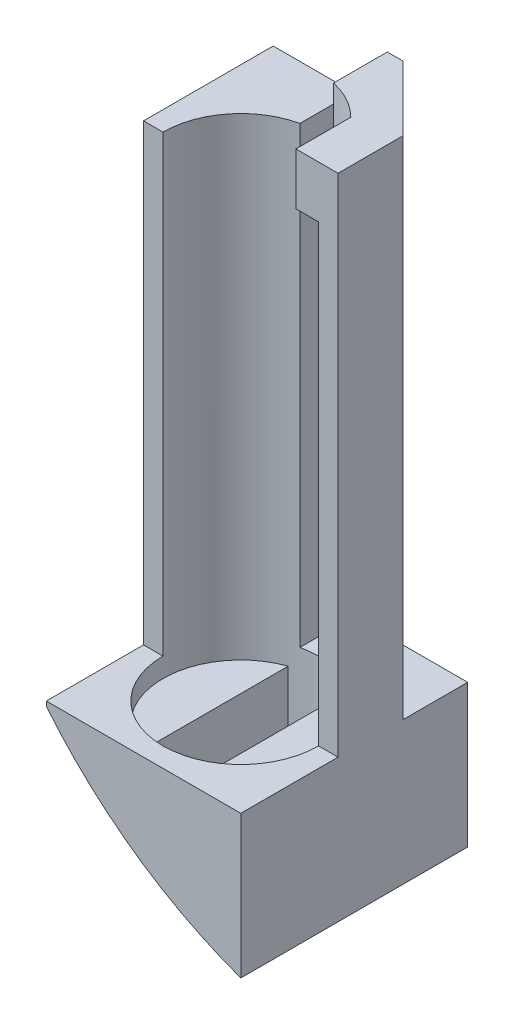
ISO-10303-21;
HEADER;
FILE_DESCRIPTION(('STEP AP214'),'2;1');
FILE_NAME('part.step','',(''),(''),'','','');
FILE_SCHEMA(('AUTOMOTIVE_DESIGN { 1 0 10303 214 1 1 1 1 }'));
ENDSEC;
DATA;
#1=APPLICATION_CONTEXT('core data for automotive mechanical design processes');
#2=APPLICATION_PROTOCOL_DEFINITION('international standard','automotive_design',2000,#1);
#3=PRODUCT_CONTEXT('',#1,'mechanical');
#4=PRODUCT('Part','Part','',(#3));
#5=PRODUCT_RELATED_PRODUCT_CATEGORY('part','',(#4));
#6=PRODUCT_DEFINITION_FORMATION('','',#4);
#7=PRODUCT_DEFINITION_CONTEXT('part definition',#1,'design');
#8=PRODUCT_DEFINITION('design','',#6,#7);
#9=PRODUCT_DEFINITION_SHAPE('','',#8);
#10=(LENGTH_UNIT() NAMED_UNIT(*) SI_UNIT(.MILLI.,.METRE.));
#11=(NAMED_UNIT(*) PLANE_ANGLE_UNIT() SI_UNIT($,.RADIAN.));
#12=(NAMED_UNIT(*) SI_UNIT($,.STERADIAN.) SOLID_ANGLE_UNIT());
#13=UNCERTAINTY_MEASURE_WITH_UNIT(LENGTH_MEASURE(1.E-05),#10,'distance_accuracy_value','');
#14=(GEOMETRIC_REPRESENTATION_CONTEXT(3) GLOBAL_UNCERTAINTY_ASSIGNED_CONTEXT((#13)) GLOBAL_UNIT_ASSIGNED_CONTEXT((#10,
#11,#12)) REPRESENTATION_CONTEXT('',''));
#15=CARTESIAN_POINT('',(0.,0.,0.));
#16=DIRECTION('',(0.,0.,1.));
#17=DIRECTION('',(1.,0.,0.));
#18=AXIS2_PLACEMENT_3D('',#15,#16,#17);
#19=CARTESIAN_POINT('',(0.,-3.,0.));
#20=DIRECTION('',(0.,1.,0.));
#21=DIRECTION('',(0.,0.,1.));
#22=AXIS2_PLACEMENT_3D('',#19,#20,#21);
#23=PLANE('',#22);
#24=DIRECTION('',(0.,0.,1.));
#25=VECTOR('',#24,1.);
#26=CARTESIAN_POINT('',(-4.,-3.,0.));
#27=LINE('',#26,#25);
#28=CARTESIAN_POINT('',(-4.,-3.,-11.3137084989848));
#29=VERTEX_POINT('',#28);
#30=CARTESIAN_POINT('',(-4.,-3.,11.3137084989848));
#31=VERTEX_POINT('',#30);
#32=EDGE_CURVE('E11',#29,#31,#27,.T.);
#33=ORIENTED_EDGE('',*,*,#32,.F.);
#34=CARTESIAN_POINT('',(0.,-3.,0.));
#35=DIRECTION('',(0.,1.,0.));
#36=DIRECTION('',(0.,0.,1.));
#37=AXIS2_PLACEMENT_3D('',#34,#35,#36);
#38=CIRCLE('',#37,12.);
#39=EDGE_CURVE('E306',#29,#31,#38,.T.);
#40=ORIENTED_EDGE('',*,*,#39,.T.);
#41=EDGE_LOOP('',(#33,#40));
#42=FACE_BOUND('',#41,.T.);
#43=ADVANCED_FACE('F45',(#42),#23,.T.);
#44=CARTESIAN_POINT('',(0.,0.,0.));
#45=DIRECTION('',(0.,-1.,0.));
#46=DIRECTION('',(0.,0.,-1.));
#47=AXIS2_PLACEMENT_3D('',#44,#45,#46);
#48=PLANE('',#47);
#49=DIRECTION('',(1.,0.,0.));
#50=VECTOR('',#49,1.);
#51=CARTESIAN_POINT('',(12.,0.,0.));
#52=LINE('',#51,#50);
#53=CARTESIAN_POINT('',(12.,0.,0.));
#54=VERTEX_POINT('',#53);
#55=CARTESIAN_POINT('',(15.,0.,0.));
#56=VERTEX_POINT('',#55);
#57=EDGE_CURVE('E343',#54,#56,#52,.T.);
#58=ORIENTED_EDGE('',*,*,#57,.F.);
#59=CARTESIAN_POINT('',(0.,0.,0.));
#60=DIRECTION('',(0.,-1.,0.));
#61=DIRECTION('',(0.,0.,-1.));
#62=AXIS2_PLACEMENT_3D('',#59,#60,#61);
#63=CIRCLE('',#62,12.);
#64=CARTESIAN_POINT('',(-12.,0.,0.));
#65=VERTEX_POINT('',#64);
#66=EDGE_CURVE('E429',#54,#65,#63,.T.);
#67=ORIENTED_EDGE('',*,*,#66,.T.);
#68=DIRECTION('',(1.,0.,0.));
#69=VECTOR('',#68,1.);
#70=CARTESIAN_POINT('',(-15.,0.,0.));
#71=LINE('',#70,#69);
#72=CARTESIAN_POINT('',(-15.,0.,0.));
#73=VERTEX_POINT('',#72);
#74=EDGE_CURVE('E377',#73,#65,#71,.T.);
#75=ORIENTED_EDGE('',*,*,#74,.F.);
#76=DIRECTION('',(0.,0.,1.));
#77=VECTOR('',#76,1.);
#78=CARTESIAN_POINT('',(-15.,0.,-20.));
#79=LINE('',#78,#77);
#80=CARTESIAN_POINT('',(-15.,0.,15.));
#81=VERTEX_POINT('',#80);
#82=EDGE_CURVE('E333',#73,#81,#79,.T.);
#83=ORIENTED_EDGE('',*,*,#82,.T.);
#84=DIRECTION('',(1.,0.,0.));
#85=VECTOR('',#84,1.);
#86=CARTESIAN_POINT('',(15.,0.,15.));
#87=LINE('',#86,#85);
#88=CARTESIAN_POINT('',(15.,0.,15.));
#89=VERTEX_POINT('',#88);
#90=EDGE_CURVE('E326',#81,#89,#87,.T.);
#91=ORIENTED_EDGE('',*,*,#90,.T.);
#92=DIRECTION('',(0.,0.,-1.));
#93=VECTOR('',#92,1.);
#94=CARTESIAN_POINT('',(15.,0.,-20.));
#95=LINE('',#94,#93);
#96=EDGE_CURVE('E327',#89,#56,#95,.T.);
#97=ORIENTED_EDGE('',*,*,#96,.T.);
#98=EDGE_LOOP('',(#58,#67,#75,#83,#91,#97));
#99=FACE_BOUND('',#98,.T.);
#100=ADVANCED_FACE('F435',(#99),#48,.F.);
#101=CARTESIAN_POINT('',(5.,70.,-20.));
#102=DIRECTION('',(0.,0.,1.));
#103=DIRECTION('',(1.,0.,0.));
#104=AXIS2_PLACEMENT_3D('',#101,#102,#103);
#105=PLANE('',#104);
#106=CARTESIAN_POINT('',(38.5,42.8748795759961,-20.));
#107=DIRECTION('',(0.,0.,1.));
#108=DIRECTION('',(1.,0.,0.));
#109=AXIS2_PLACEMENT_3D('',#106,#107,#108);
#110=CIRCLE('',#109,69.);
#111=CARTESIAN_POINT('',(-15.,-0.699769016964391,-20.));
#112=VERTEX_POINT('',#111);
#113=CARTESIAN_POINT('',(15.,-22.,-20.));
#114=VERTEX_POINT('',#113);
#115=EDGE_CURVE('E315',#112,#114,#110,.T.);
#116=ORIENTED_EDGE('',*,*,#115,.F.);
#117=DIRECTION('',(0.,-1.,0.));
#118=VECTOR('',#117,1.);
#119=CARTESIAN_POINT('',(-15.,70.,-20.));
#120=LINE('',#119,#118);
#121=CARTESIAN_POINT('',(-15.,70.,-20.));
#122=VERTEX_POINT('',#121);
#123=EDGE_CURVE('E415',#122,#112,#120,.T.);
#124=ORIENTED_EDGE('',*,*,#123,.F.);
#125=DIRECTION('',(-1.,0.,0.));
#126=VECTOR('',#125,1.);
#127=CARTESIAN_POINT('',(5.,70.,-20.));
#128=LINE('',#127,#126);
#129=CARTESIAN_POINT('',(2.6,70.,-20.));
#130=VERTEX_POINT('',#129);
#131=EDGE_CURVE('E351',#130,#122,#128,.T.);
#132=ORIENTED_EDGE('',*,*,#131,.F.);
#133=DIRECTION('',(0.,-1.,0.));
#134=VECTOR('',#133,1.);
#135=CARTESIAN_POINT('',(2.6,78.,-20.));
#136=LINE('',#135,#134);
#137=CARTESIAN_POINT('',(2.6,78.,-20.));
#138=VERTEX_POINT('',#137);
#139=EDGE_CURVE('E250',#138,#130,#136,.T.);
#140=ORIENTED_EDGE('',*,*,#139,.F.);
#141=DIRECTION('',(-1.,0.,0.));
#142=VECTOR('',#141,1.);
#143=CARTESIAN_POINT('',(5.,78.,-20.));
#144=LINE('',#143,#142);
#145=CARTESIAN_POINT('',(5.,78.,-20.));
#146=VERTEX_POINT('',#145);
#147=EDGE_CURVE('E211',#146,#138,#144,.T.);
#148=ORIENTED_EDGE('',*,*,#147,.F.);
#149=DIRECTION('',(0.,-1.,0.));
#150=VECTOR('',#149,1.);
#151=CARTESIAN_POINT('',(5.,70.,-20.));
#152=LINE('',#151,#150);
#153=CARTESIAN_POINT('',(5.,0.,-20.));
#154=VERTEX_POINT('',#153);
#155=EDGE_CURVE('E202',#146,#154,#152,.T.);
#156=ORIENTED_EDGE('',*,*,#155,.T.);
#157=DIRECTION('',(-1.,0.,0.));
#158=VECTOR('',#157,1.);
#159=CARTESIAN_POINT('',(15.,0.,-20.));
#160=LINE('',#159,#158);
#161=CARTESIAN_POINT('',(15.,0.,-20.));
#162=VERTEX_POINT('',#161);
#163=EDGE_CURVE('E330',#162,#154,#160,.T.);
#164=ORIENTED_EDGE('',*,*,#163,.F.);
#165=DIRECTION('',(0.,1.,0.));
#166=VECTOR('',#165,1.);
#167=CARTESIAN_POINT('',(15.,-22.,-20.));
#168=LINE('',#167,#166);
#169=EDGE_CURVE('E325',#114,#162,#168,.T.);
#170=ORIENTED_EDGE('',*,*,#169,.F.);
#171=EDGE_LOOP('',(#116,#124,#132,#140,#148,#156,#164,#170));
#172=FACE_BOUND('',#171,.T.);
#173=ADVANCED_FACE('F497',(#172),#105,.F.);
#174=CARTESIAN_POINT('',(-15.,70.,-20.));
#175=DIRECTION('',(1.,0.,0.));
#176=DIRECTION('',(0.,0.,-1.));
#177=AXIS2_PLACEMENT_3D('',#174,#175,#176);
#178=PLANE('',#177);
#179=DIRECTION('',(0.,0.,1.));
#180=VECTOR('',#179,1.);
#181=CARTESIAN_POINT('',(-15.,-0.699769016964391,-20.));
#182=LINE('',#181,#180);
#183=CARTESIAN_POINT('',(-15.,-0.699769016964391,15.));
#184=VERTEX_POINT('',#183);
#185=EDGE_CURVE('E318',#184,#112,#182,.F.);
#186=ORIENTED_EDGE('',*,*,#185,.F.);
#187=DIRECTION('',(0.,1.,0.));
#188=VECTOR('',#187,1.);
#189=CARTESIAN_POINT('',(-15.,-22.,15.));
#190=LINE('',#189,#188);
#191=EDGE_CURVE('E344',#184,#81,#190,.T.);
#192=ORIENTED_EDGE('',*,*,#191,.T.);
#193=ORIENTED_EDGE('',*,*,#82,.F.);
#194=DIRECTION('',(0.,-1.,0.));
#195=VECTOR('',#194,1.);
#196=CARTESIAN_POINT('',(-15.,70.,0.));
#197=LINE('',#196,#195);
#198=CARTESIAN_POINT('',(-15.,70.,0.));
#199=VERTEX_POINT('',#198);
#200=EDGE_CURVE('E411',#199,#73,#197,.T.);
#201=ORIENTED_EDGE('',*,*,#200,.F.);
#202=DIRECTION('',(0.,0.,1.));
#203=VECTOR('',#202,1.);
#204=CARTESIAN_POINT('',(-15.,70.,-20.));
#205=LINE('',#204,#203);
#206=EDGE_CURVE('E355',#122,#199,#205,.T.);
#207=ORIENTED_EDGE('',*,*,#206,.F.);
#208=ORIENTED_EDGE('',*,*,#123,.T.);
#209=EDGE_LOOP('',(#186,#192,#193,#201,#207,#208));
#210=FACE_BOUND('',#209,.T.);
#211=ADVANCED_FACE('F452',(#210),#178,.F.);
#212=CARTESIAN_POINT('',(15.,-22.,15.));
#213=DIRECTION('',(0.,0.,1.));
#214=DIRECTION('',(1.,0.,0.));
#215=AXIS2_PLACEMENT_3D('',#212,#213,#214);
#216=PLANE('',#215);
#217=ORIENTED_EDGE('',*,*,#191,.F.);
#218=CARTESIAN_POINT('',(38.5,42.8748795759961,15.));
#219=DIRECTION('',(0.,0.,1.));
#220=DIRECTION('',(1.,0.,0.));
#221=AXIS2_PLACEMENT_3D('',#218,#219,#220);
#222=CIRCLE('',#221,69.);
#223=CARTESIAN_POINT('',(15.0000000000001,-22.,15.));
#224=VERTEX_POINT('',#223);
#225=EDGE_CURVE('E311',#184,#224,#222,.T.);
#226=ORIENTED_EDGE('',*,*,#225,.T.);
#227=DIRECTION('',(0.,1.,0.));
#228=VECTOR('',#227,1.);
#229=CARTESIAN_POINT('',(15.,-22.,15.));
#230=LINE('',#229,#228);
#231=EDGE_CURVE('E340',#224,#89,#230,.T.);
#232=ORIENTED_EDGE('',*,*,#231,.T.);
#233=ORIENTED_EDGE('',*,*,#90,.F.);
#234=EDGE_LOOP('',(#217,#226,#232,#233));
#235=FACE_BOUND('',#234,.T.);
#236=ADVANCED_FACE('F456',(#235),#216,.T.);
#237=CARTESIAN_POINT('',(12.,70.,0.));
#238=DIRECTION('',(0.,0.,-1.));
#239=DIRECTION('',(-1.,0.,0.));
#240=AXIS2_PLACEMENT_3D('',#237,#238,#239);
#241=PLANE('',#240);
#242=ORIENTED_EDGE('',*,*,#57,.T.);
#243=DIRECTION('',(0.,-1.,0.));
#244=VECTOR('',#243,1.);
#245=CARTESIAN_POINT('',(15.,70.,0.));
#246=LINE('',#245,#244);
#247=CARTESIAN_POINT('',(15.,78.,0.));
#248=VERTEX_POINT('',#247);
#249=EDGE_CURVE('E201',#248,#56,#246,.T.);
#250=ORIENTED_EDGE('',*,*,#249,.F.);
#251=DIRECTION('',(1.,0.,0.));
#252=VECTOR('',#251,1.);
#253=CARTESIAN_POINT('',(15.,78.,0.));
#254=LINE('',#253,#252);
#255=CARTESIAN_POINT('',(8.5,78.,0.));
#256=VERTEX_POINT('',#255);
#257=EDGE_CURVE('E216',#256,#248,#254,.T.);
#258=ORIENTED_EDGE('',*,*,#257,.F.);
#259=DIRECTION('',(0.,-1.,0.));
#260=VECTOR('',#259,1.);
#261=CARTESIAN_POINT('',(8.5,78.,0.));
#262=LINE('',#261,#260);
#263=CARTESIAN_POINT('',(8.5,70.,0.));
#264=VERTEX_POINT('',#263);
#265=EDGE_CURVE('E239',#256,#264,#262,.T.);
#266=ORIENTED_EDGE('',*,*,#265,.T.);
#267=DIRECTION('',(1.,0.,0.));
#268=VECTOR('',#267,1.);
#269=CARTESIAN_POINT('',(15.,70.,0.));
#270=LINE('',#269,#268);
#271=CARTESIAN_POINT('',(12.,70.,0.));
#272=VERTEX_POINT('',#271);
#273=EDGE_CURVE('E218',#264,#272,#270,.T.);
#274=ORIENTED_EDGE('',*,*,#273,.T.);
#275=DIRECTION('',(0.,-1.,0.));
#276=VECTOR('',#275,1.);
#277=CARTESIAN_POINT('',(12.,70.,0.));
#278=LINE('',#277,#276);
#279=EDGE_CURVE('E423',#272,#54,#278,.T.);
#280=ORIENTED_EDGE('',*,*,#279,.T.);
#281=EDGE_LOOP('',(#242,#250,#258,#266,#274,#280));
#282=FACE_BOUND('',#281,.T.);
#283=ADVANCED_FACE('F47',(#282),#241,.F.);
#284=CARTESIAN_POINT('',(15.,70.,0.));
#285=DIRECTION('',(-1.,0.,0.));
#286=DIRECTION('',(0.,0.,1.));
#287=AXIS2_PLACEMENT_3D('',#284,#285,#286);
#288=PLANE('',#287);
#289=ORIENTED_EDGE('',*,*,#249,.T.);
#290=ORIENTED_EDGE('',*,*,#96,.F.);
#291=ORIENTED_EDGE('',*,*,#231,.F.);
#292=DIRECTION('',(0.,0.,-1.));
#293=VECTOR('',#292,1.);
#294=CARTESIAN_POINT('',(15.,-22.,-20.));
#295=LINE('',#294,#293);
#296=EDGE_CURVE('E321',#224,#114,#295,.T.);
#297=ORIENTED_EDGE('',*,*,#296,.T.);
#298=ORIENTED_EDGE('',*,*,#169,.T.);
#299=CARTESIAN_POINT('',(15.,0.,-10.));
#300=VERTEX_POINT('',#299);
#301=EDGE_CURVE('E197',#300,#162,#95,.T.);
#302=ORIENTED_EDGE('',*,*,#301,.F.);
#303=DIRECTION('',(0.,-1.,0.));
#304=VECTOR('',#303,1.);
#305=CARTESIAN_POINT('',(15.,70.,-10.));
#306=LINE('',#305,#304);
#307=CARTESIAN_POINT('',(15.,78.,-10.));
#308=VERTEX_POINT('',#307);
#309=EDGE_CURVE('E190',#308,#300,#306,.T.);
#310=ORIENTED_EDGE('',*,*,#309,.F.);
#311=DIRECTION('',(0.,0.,-1.));
#312=VECTOR('',#311,1.);
#313=CARTESIAN_POINT('',(15.,78.,0.));
#314=LINE('',#313,#312);
#315=EDGE_CURVE('E195',#248,#308,#314,.T.);
#316=ORIENTED_EDGE('',*,*,#315,.F.);
#317=EDGE_LOOP('',(#289,#290,#291,#297,#298,#302,#310,#316));
#318=FACE_BOUND('',#317,.T.);
#319=ADVANCED_FACE('F193',(#318),#288,.F.);
#320=CARTESIAN_POINT('',(15.,70.,-10.));
#321=DIRECTION('',(-0.707106781186548,0.,0.707106781186548));
#322=DIRECTION('',(0.707106781186548,0.,0.707106781186547));
#323=AXIS2_PLACEMENT_3D('',#320,#321,#322);
#324=PLANE('',#323);
#325=DIRECTION('',(-0.707106781186548,0.,-0.707106781186547));
#326=VECTOR('',#325,1.);
#327=CARTESIAN_POINT('',(15.,0.,-10.));
#328=LINE('',#327,#326);
#329=EDGE_CURVE('E374',#300,#154,#328,.T.);
#330=ORIENTED_EDGE('',*,*,#329,.T.);
#331=ORIENTED_EDGE('',*,*,#155,.F.);
#332=DIRECTION('',(-0.707106781186548,0.,-0.707106781186547));
#333=VECTOR('',#332,1.);
#334=CARTESIAN_POINT('',(15.,78.,-10.));
#335=LINE('',#334,#333);
#336=EDGE_CURVE('E205',#308,#146,#335,.T.);
#337=ORIENTED_EDGE('',*,*,#336,.F.);
#338=ORIENTED_EDGE('',*,*,#309,.T.);
#339=EDGE_LOOP('',(#330,#331,#337,#338));
#340=FACE_BOUND('',#339,.T.);
#341=ADVANCED_FACE('F206',(#340),#324,.F.);
#342=CARTESIAN_POINT('',(-15.,70.,0.));
#343=DIRECTION('',(0.,0.,-1.));
#344=DIRECTION('',(-1.,0.,0.));
#345=AXIS2_PLACEMENT_3D('',#342,#343,#344);
#346=PLANE('',#345);
#347=ORIENTED_EDGE('',*,*,#74,.T.);
#348=DIRECTION('',(0.,-1.,0.));
#349=VECTOR('',#348,1.);
#350=CARTESIAN_POINT('',(-12.,70.,0.));
#351=LINE('',#350,#349);
#352=CARTESIAN_POINT('',(-12.,70.,0.));
#353=VERTEX_POINT('',#352);
#354=EDGE_CURVE('E407',#353,#65,#351,.T.);
#355=ORIENTED_EDGE('',*,*,#354,.F.);
#356=DIRECTION('',(1.,0.,0.));
#357=VECTOR('',#356,1.);
#358=CARTESIAN_POINT('',(-15.,70.,0.));
#359=LINE('',#358,#357);
#360=EDGE_CURVE('E358',#199,#353,#359,.T.);
#361=ORIENTED_EDGE('',*,*,#360,.F.);
#362=ORIENTED_EDGE('',*,*,#200,.T.);
#363=EDGE_LOOP('',(#347,#355,#361,#362));
#364=FACE_BOUND('',#363,.T.);
#365=ADVANCED_FACE('F439',(#364),#346,.F.);
#366=CARTESIAN_POINT('',(0.,70.,0.));
#367=DIRECTION('',(0.,-1.,0.));
#368=DIRECTION('',(0.,0.,-1.));
#369=AXIS2_PLACEMENT_3D('',#366,#367,#368);
#370=CYLINDRICAL_SURFACE('',#369,12.);
#371=DIRECTION('',(0.,1.,0.));
#372=VECTOR('',#371,1.);
#373=CARTESIAN_POINT('',(-4.,-22.,11.3137084989848));
#374=LINE('',#373,#372);
#375=CARTESIAN_POINT('',(-4.,-11.4827325864232,11.3137084989848));
#376=VERTEX_POINT('',#375);
#377=EDGE_CURVE('E255',#376,#31,#374,.T.);
#378=ORIENTED_EDGE('',*,*,#377,.T.);
#379=ORIENTED_EDGE('',*,*,#39,.F.);
#380=DIRECTION('',(0.,1.,0.));
#381=VECTOR('',#380,1.);
#382=CARTESIAN_POINT('',(-4.,-22.,-11.3137084989848));
#383=LINE('',#382,#381);
#384=CARTESIAN_POINT('',(-4.,-11.4827325864232,-11.3137084989848));
#385=VERTEX_POINT('',#384);
#386=EDGE_CURVE('E260',#385,#29,#383,.T.);
#387=ORIENTED_EDGE('',*,*,#386,.F.);
#388=CARTESIAN_POINT('',(-3.99999999999999,-11.4827325864232,-11.3137084989848));
#389=CARTESIAN_POINT('',(-3.80405953769929,-11.6359323063262,-11.3829780983557));
#390=CARTESIAN_POINT('',(-3.60620726462204,-11.7889153987008,-11.4472085622099));
#391=CARTESIAN_POINT('',(-3.2069105956966,-12.0941730568118,-11.5654276411159));
#392=CARTESIAN_POINT('',(-3.00546599554075,-12.2464475816244,-11.6194156716008));
#393=CARTESIAN_POINT('',(-2.39579426762107,-12.7020161847794,-11.765839111899));
#394=CARTESIAN_POINT('',(-1.98254895388249,-13.0038049845758,-11.842620553935));
#395=CARTESIAN_POINT('',(-1.15663387974078,-13.5928268010616,-11.9511949400565));
#396=CARTESIAN_POINT('',(-0.744236486243592,-13.880233785037,-11.9841211918033));
#397=CARTESIAN_POINT('',(0.0873063786256174,-14.4463026119503,-12.0068863498595));
#398=CARTESIAN_POINT('',(0.506447392997863,-14.7249698987098,-11.996752636986));
#399=CARTESIAN_POINT('',(1.4353222824399,-15.3280018188528,-11.9247234380764));
#400=CARTESIAN_POINT('',(1.94592215561218,-15.6499466147311,-11.8525895789184));
#401=CARTESIAN_POINT('',(2.71397292083672,-16.1204827831252,-11.6920631931473));
#402=CARTESIAN_POINT('',(2.97243214412828,-16.2764655231495,-11.6291110300699));
#403=CARTESIAN_POINT('',(3.48772640276312,-16.5829266071149,-11.4850913469716));
#404=CARTESIAN_POINT('',(3.7445606234869,-16.7334023472219,-11.4040153831638));
#405=CARTESIAN_POINT('',(4.,-16.8808732851301,-11.3137084989848));
#406=B_SPLINE_CURVE_WITH_KNOTS('',3,(#388,#389,#390,#391,#392,#393,#394,#395,#396,#397,#398,
#399,#400,#401,#402,#403,#404,#405),.UNSPECIFIED.,.F.,.F.,(4,2,2,2,2,2,2,2,4),(0.,
0.774446563668574,1.54893731407127,3.09917947290577,4.60852837827478,6.11691766790515,
7.93620892520573,8.8608241983137,9.78587114613033),.UNSPECIFIED.);
#407=CARTESIAN_POINT('',(4.,-16.8808732851301,-11.3137084989848));
#408=VERTEX_POINT('',#407);
#409=EDGE_CURVE('E271',#385,#408,#406,.T.);
#410=ORIENTED_EDGE('',*,*,#409,.T.);
#411=DIRECTION('',(0.,1.,0.));
#412=VECTOR('',#411,1.);
#413=CARTESIAN_POINT('',(4.,-22.,-11.3137084989848));
#414=LINE('',#413,#412);
#415=CARTESIAN_POINT('',(4.,-3.,-11.3137084989848));
#416=VERTEX_POINT('',#415);
#417=EDGE_CURVE('E263',#408,#416,#414,.T.);
#418=ORIENTED_EDGE('',*,*,#417,.T.);
#419=CARTESIAN_POINT('',(4.,-3.,11.3137084989848));
#420=VERTEX_POINT('',#419);
#421=EDGE_CURVE('E307',#420,#416,#38,.T.);
#422=ORIENTED_EDGE('',*,*,#421,.F.);
#423=DIRECTION('',(0.,1.,0.));
#424=VECTOR('',#423,1.);
#425=CARTESIAN_POINT('',(4.,-22.,11.3137084989848));
#426=LINE('',#425,#424);
#427=CARTESIAN_POINT('',(4.,-16.8808732851301,11.3137084989848));
#428=VERTEX_POINT('',#427);
#429=EDGE_CURVE('E254',#428,#420,#426,.T.);
#430=ORIENTED_EDGE('',*,*,#429,.F.);
#431=CARTESIAN_POINT('',(4.,-16.8808732851301,11.3137084989848));
#432=CARTESIAN_POINT('',(3.78461879849227,-16.7565265206017,11.3898550937831));
#433=CARTESIAN_POINT('',(3.56823072823716,-16.6300377786155,11.4594421907849));
#434=CARTESIAN_POINT('',(3.13411739202736,-16.3730562570849,11.5856989385388));
#435=CARTESIAN_POINT('',(2.91639235983347,-16.2425641624099,11.6423707849266));
#436=CARTESIAN_POINT('',(2.26262756038014,-15.8457486523241,11.7932330097613));
#437=CARTESIAN_POINT('',(1.82548967585022,-15.5737929975452,11.8684477223463));
#438=CARTESIAN_POINT('',(0.964569620132388,-15.0245670956227,11.96882734587));
#439=CARTESIAN_POINT('',(0.540727619318458,-14.7476015740974,11.995201107556));
#440=CARTESIAN_POINT('',(-0.301034693039968,-14.1841777095978,12.0036019326696));
#441=CARTESIAN_POINT('',(-0.718955461340733,-13.8977201045849,11.9856324356177));
#442=CARTESIAN_POINT('',(-1.3773619632976,-13.4357400225657,11.9232349580021));
#443=CARTESIAN_POINT('',(-1.62085904935085,-13.2625007502148,11.8925462876849));
#444=CARTESIAN_POINT('',(-2.10403123277349,-12.9140198044772,11.8166332089537));
#445=CARTESIAN_POINT('',(-2.34370751047235,-12.7387787793613,11.7714133845802));
#446=CARTESIAN_POINT('',(-2.82242332704285,-12.3840329001744,11.6659735599404));
#447=CARTESIAN_POINT('',(-3.06139634833472,-12.2045039249831,11.605533501722));
#448=CARTESIAN_POINT('',(-3.53448273108557,-11.8443207073744,11.4703062262485));
#449=CARTESIAN_POINT('',(-3.76859488753281,-11.6636662000323,11.3955154974214));
#450=CARTESIAN_POINT('',(-4.00000000000001,-11.4827325864232,11.3137084989848));
#451=B_SPLINE_CURVE_WITH_KNOTS('',3,(#431,#432,#433,#434,#435,#436,#437,#438,#439,#440,#441,
#442,#443,#444,#445,#446,#447,#448,#449,#450),.UNSPECIFIED.,.F.,.F.,(4,2,2,2,2,2,2,2,2,4),(0.,
0.78007780273891,1.56002289055577,3.11808254553655,4.63703534940833,6.15587033819197,
7.05675841316004,7.95736256987227,8.87182144271636,9.78650436730514),.UNSPECIFIED.);
#452=EDGE_CURVE('E299',#428,#376,#451,.T.);
#453=ORIENTED_EDGE('',*,*,#452,.T.);
#454=EDGE_LOOP('',(#378,#379,#387,#410,#418,#422,#430,#453));
#455=FACE_BOUND('',#454,.T.);
#456=ORIENTED_EDGE('',*,*,#354,.T.);
#457=ORIENTED_EDGE('',*,*,#66,.F.);
#458=ORIENTED_EDGE('',*,*,#279,.F.);
#459=CARTESIAN_POINT('',(0.,70.,0.));
#460=DIRECTION('',(0.,-1.,0.));
#461=DIRECTION('',(0.,0.,1.));
#462=AXIS2_PLACEMENT_3D('',#459,#460,#461);
#463=CIRCLE('',#462,12.);
#464=CARTESIAN_POINT('',(8.5,70.,-8.47053717304871));
#465=VERTEX_POINT('',#464);
#466=EDGE_CURVE('E69',#465,#272,#463,.T.);
#467=ORIENTED_EDGE('',*,*,#466,.F.);
#468=DIRECTION('',(0.,-1.,0.));
#469=VECTOR('',#468,1.);
#470=CARTESIAN_POINT('',(8.5,78.,-8.47053717304871));
#471=LINE('',#470,#469);
#472=CARTESIAN_POINT('',(8.5,78.,-8.47053717304871));
#473=VERTEX_POINT('',#472);
#474=EDGE_CURVE('E247',#473,#465,#471,.T.);
#475=ORIENTED_EDGE('',*,*,#474,.F.);
#476=CARTESIAN_POINT('',(0.,78.,0.));
#477=DIRECTION('',(0.,-1.,0.));
#478=DIRECTION('',(0.,0.,1.));
#479=AXIS2_PLACEMENT_3D('',#476,#477,#478);
#480=CIRCLE('',#479,12.);
#481=CARTESIAN_POINT('',(2.6,78.,-11.714947716486));
#482=VERTEX_POINT('',#481);
#483=EDGE_CURVE('E231',#482,#473,#480,.T.);
#484=ORIENTED_EDGE('',*,*,#483,.F.);
#485=DIRECTION('',(0.,-1.,0.));
#486=VECTOR('',#485,1.);
#487=CARTESIAN_POINT('',(2.6,70.,-11.714947716486));
#488=LINE('',#487,#486);
#489=CARTESIAN_POINT('',(2.6,0.,-11.714947716486));
#490=VERTEX_POINT('',#489);
#491=EDGE_CURVE('E370',#482,#490,#488,.T.);
#492=ORIENTED_EDGE('',*,*,#491,.T.);
#493=CARTESIAN_POINT('',(-2.6,0.,-11.714947716486));
#494=VERTEX_POINT('',#493);
#495=EDGE_CURVE('E427',#494,#490,#63,.T.);
#496=ORIENTED_EDGE('',*,*,#495,.F.);
#497=DIRECTION('',(0.,-1.,0.));
#498=VECTOR('',#497,1.);
#499=CARTESIAN_POINT('',(-2.6,70.,-11.714947716486));
#500=LINE('',#499,#498);
#501=CARTESIAN_POINT('',(-2.6,70.,-11.714947716486));
#502=VERTEX_POINT('',#501);
#503=EDGE_CURVE('E403',#502,#494,#500,.T.);
#504=ORIENTED_EDGE('',*,*,#503,.F.);
#505=CARTESIAN_POINT('',(0.,70.,0.));
#506=DIRECTION('',(0.,-1.,0.));
#507=DIRECTION('',(0.,0.,1.));
#508=AXIS2_PLACEMENT_3D('',#505,#506,#507);
#509=CIRCLE('',#508,12.);
#510=EDGE_CURVE('E361',#353,#502,#509,.T.);
#511=ORIENTED_EDGE('',*,*,#510,.F.);
#512=EDGE_LOOP('',(#456,#457,#458,#467,#475,#484,#492,#496,#504,#511));
#513=FACE_BOUND('',#512,.T.);
#514=ADVANCED_FACE('F443',(#455,#513),#370,.F.);
#515=CARTESIAN_POINT('',(-2.6,70.,-17.2));
#516=DIRECTION('',(-1.,0.,0.));
#517=DIRECTION('',(0.,0.,1.));
#518=AXIS2_PLACEMENT_3D('',#515,#516,#517);
#519=PLANE('',#518);
#520=DIRECTION('',(0.,0.,-1.));
#521=VECTOR('',#520,1.);
#522=CARTESIAN_POINT('',(-2.6,0.,-17.2));
#523=LINE('',#522,#521);
#524=CARTESIAN_POINT('',(-2.6,0.,-17.2));
#525=VERTEX_POINT('',#524);
#526=EDGE_CURVE('E381',#494,#525,#523,.T.);
#527=ORIENTED_EDGE('',*,*,#526,.T.);
#528=DIRECTION('',(0.,-1.,0.));
#529=VECTOR('',#528,1.);
#530=CARTESIAN_POINT('',(-2.6,70.,-17.2));
#531=LINE('',#530,#529);
#532=CARTESIAN_POINT('',(-2.6,70.,-17.2));
#533=VERTEX_POINT('',#532);
#534=EDGE_CURVE('E399',#533,#525,#531,.T.);
#535=ORIENTED_EDGE('',*,*,#534,.F.);
#536=DIRECTION('',(0.,0.,-1.));
#537=VECTOR('',#536,1.);
#538=CARTESIAN_POINT('',(-2.6,70.,-17.2));
#539=LINE('',#538,#537);
#540=EDGE_CURVE('E364',#502,#533,#539,.T.);
#541=ORIENTED_EDGE('',*,*,#540,.F.);
#542=ORIENTED_EDGE('',*,*,#503,.T.);
#543=EDGE_LOOP('',(#527,#535,#541,#542));
#544=FACE_BOUND('',#543,.T.);
#545=ADVANCED_FACE('F480',(#544),#519,.F.);
#546=CARTESIAN_POINT('',(2.6,70.,-17.2));
#547=DIRECTION('',(0.,0.,-1.));
#548=DIRECTION('',(-1.,0.,0.));
#549=AXIS2_PLACEMENT_3D('',#546,#547,#548);
#550=PLANE('',#549);
#551=DIRECTION('',(1.,0.,0.));
#552=VECTOR('',#551,1.);
#553=CARTESIAN_POINT('',(2.6,0.,-17.2));
#554=LINE('',#553,#552);
#555=CARTESIAN_POINT('',(2.6,0.,-17.2));
#556=VERTEX_POINT('',#555);
#557=EDGE_CURVE('E385',#525,#556,#554,.T.);
#558=ORIENTED_EDGE('',*,*,#557,.T.);
#559=DIRECTION('',(0.,-1.,0.));
#560=VECTOR('',#559,1.);
#561=CARTESIAN_POINT('',(2.6,70.,-17.2));
#562=LINE('',#561,#560);
#563=CARTESIAN_POINT('',(2.6,70.,-17.2));
#564=VERTEX_POINT('',#563);
#565=EDGE_CURVE('E395',#564,#556,#562,.T.);
#566=ORIENTED_EDGE('',*,*,#565,.F.);
#567=DIRECTION('',(1.,0.,0.));
#568=VECTOR('',#567,1.);
#569=CARTESIAN_POINT('',(2.6,70.,-17.2));
#570=LINE('',#569,#568);
#571=EDGE_CURVE('E367',#533,#564,#570,.T.);
#572=ORIENTED_EDGE('',*,*,#571,.F.);
#573=ORIENTED_EDGE('',*,*,#534,.T.);
#574=EDGE_LOOP('',(#558,#566,#572,#573));
#575=FACE_BOUND('',#574,.T.);
#576=ADVANCED_FACE('F477',(#575),#550,.F.);
#577=CARTESIAN_POINT('',(2.6,70.,-11.714947716486));
#578=DIRECTION('',(1.,0.,0.));
#579=DIRECTION('',(0.,0.,-1.));
#580=AXIS2_PLACEMENT_3D('',#577,#578,#579);
#581=PLANE('',#580);
#582=DIRECTION('',(0.,0.,1.));
#583=VECTOR('',#582,1.);
#584=CARTESIAN_POINT('',(2.6,0.,-11.714947716486));
#585=LINE('',#584,#583);
#586=EDGE_CURVE('E352',#556,#490,#585,.T.);
#587=ORIENTED_EDGE('',*,*,#586,.T.);
#588=ORIENTED_EDGE('',*,*,#491,.F.);
#589=DIRECTION('',(0.,0.,1.));
#590=VECTOR('',#589,1.);
#591=CARTESIAN_POINT('',(2.6,78.,-20.));
#592=LINE('',#591,#590);
#593=EDGE_CURVE('E227',#138,#482,#592,.T.);
#594=ORIENTED_EDGE('',*,*,#593,.F.);
#595=ORIENTED_EDGE('',*,*,#139,.T.);
#596=DIRECTION('',(0.,0.,1.));
#597=VECTOR('',#596,1.);
#598=CARTESIAN_POINT('',(2.6,70.,-20.));
#599=LINE('',#598,#597);
#600=EDGE_CURVE('E61',#130,#564,#599,.T.);
#601=ORIENTED_EDGE('',*,*,#600,.T.);
#602=ORIENTED_EDGE('',*,*,#565,.T.);
#603=EDGE_LOOP('',(#587,#588,#594,#595,#601,#602));
#604=FACE_BOUND('',#603,.T.);
#605=ADVANCED_FACE('F471',(#604),#581,.F.);
#606=CARTESIAN_POINT('',(0.,70.,0.));
#607=DIRECTION('',(0.,1.,0.));
#608=DIRECTION('',(0.,0.,1.));
#609=AXIS2_PLACEMENT_3D('',#606,#607,#608);
#610=PLANE('',#609);
#611=ORIENTED_EDGE('',*,*,#600,.F.);
#612=ORIENTED_EDGE('',*,*,#131,.T.);
#613=ORIENTED_EDGE('',*,*,#206,.T.);
#614=ORIENTED_EDGE('',*,*,#360,.T.);
#615=ORIENTED_EDGE('',*,*,#510,.T.);
#616=ORIENTED_EDGE('',*,*,#540,.T.);
#617=ORIENTED_EDGE('',*,*,#571,.T.);
#618=EDGE_LOOP('',(#611,#612,#613,#614,#615,#616,#617));
#619=FACE_BOUND('',#618,.T.);
#620=ADVANCED_FACE('F446',(#619),#610,.T.);
#621=ORIENTED_EDGE('',*,*,#329,.F.);
#622=ORIENTED_EDGE('',*,*,#301,.T.);
#623=ORIENTED_EDGE('',*,*,#163,.T.);
#624=EDGE_LOOP('',(#621,#622,#623));
#625=FACE_BOUND('',#624,.T.);
#626=ADVANCED_FACE('F498',(#625),#48,.F.);
#627=ORIENTED_EDGE('',*,*,#526,.F.);
#628=ORIENTED_EDGE('',*,*,#495,.T.);
#629=ORIENTED_EDGE('',*,*,#586,.F.);
#630=ORIENTED_EDGE('',*,*,#557,.F.);
#631=EDGE_LOOP('',(#627,#628,#629,#630));
#632=FACE_BOUND('',#631,.T.);
#633=ADVANCED_FACE('F475',(#632),#48,.F.);
#634=CARTESIAN_POINT('',(38.5,42.8748795759961,-20.));
#635=DIRECTION('',(0.,0.,1.));
#636=DIRECTION('',(1.,0.,0.));
#637=AXIS2_PLACEMENT_3D('',#634,#635,#636);
#638=CYLINDRICAL_SURFACE('',#637,69.);
#639=ORIENTED_EDGE('',*,*,#452,.F.);
#640=DIRECTION('',(0.,0.,1.));
#641=VECTOR('',#640,1.);
#642=CARTESIAN_POINT('',(4.,-16.8808732851301,-20.));
#643=LINE('',#642,#641);
#644=EDGE_CURVE('E259',#408,#428,#643,.T.);
#645=ORIENTED_EDGE('',*,*,#644,.F.);
#646=ORIENTED_EDGE('',*,*,#409,.F.);
#647=DIRECTION('',(0.,0.,1.));
#648=VECTOR('',#647,1.);
#649=CARTESIAN_POINT('',(-4.,-11.4827325864232,-20.));
#650=LINE('',#649,#648);
#651=EDGE_CURVE('E281',#376,#385,#650,.F.);
#652=ORIENTED_EDGE('',*,*,#651,.F.);
#653=EDGE_LOOP('',(#639,#645,#646,#652));
#654=FACE_BOUND('',#653,.T.);
#655=ORIENTED_EDGE('',*,*,#185,.T.);
#656=ORIENTED_EDGE('',*,*,#115,.T.);
#657=ORIENTED_EDGE('',*,*,#296,.F.);
#658=ORIENTED_EDGE('',*,*,#225,.F.);
#659=EDGE_LOOP('',(#655,#656,#657,#658));
#660=FACE_BOUND('',#659,.T.);
#661=ADVANCED_FACE('F283',(#654,#660),#638,.T.);
#662=DIRECTION('',(0.,0.,-1.));
#663=VECTOR('',#662,1.);
#664=CARTESIAN_POINT('',(4.,-3.,0.));
#665=LINE('',#664,#663);
#666=EDGE_CURVE('E54',#420,#416,#665,.T.);
#667=ORIENTED_EDGE('',*,*,#666,.F.);
#668=ORIENTED_EDGE('',*,*,#421,.T.);
#669=EDGE_LOOP('',(#667,#668));
#670=FACE_BOUND('',#669,.T.);
#671=ADVANCED_FACE('F298',(#670),#23,.T.);
#672=CARTESIAN_POINT('',(-4.,-22.,-11.3137084989848));
#673=DIRECTION('',(-1.,0.,0.));
#674=DIRECTION('',(0.,0.,1.));
#675=AXIS2_PLACEMENT_3D('',#672,#673,#674);
#676=PLANE('',#675);
#677=ORIENTED_EDGE('',*,*,#651,.T.);
#678=ORIENTED_EDGE('',*,*,#386,.T.);
#679=ORIENTED_EDGE('',*,*,#32,.T.);
#680=ORIENTED_EDGE('',*,*,#377,.F.);
#681=EDGE_LOOP('',(#677,#678,#679,#680));
#682=FACE_BOUND('',#681,.T.);
#683=ADVANCED_FACE('F290',(#682),#676,.F.);
#684=CARTESIAN_POINT('',(4.,-22.,11.3137084989848));
#685=DIRECTION('',(1.,0.,0.));
#686=DIRECTION('',(0.,0.,-1.));
#687=AXIS2_PLACEMENT_3D('',#684,#685,#686);
#688=PLANE('',#687);
#689=ORIENTED_EDGE('',*,*,#644,.T.);
#690=ORIENTED_EDGE('',*,*,#429,.T.);
#691=ORIENTED_EDGE('',*,*,#666,.T.);
#692=ORIENTED_EDGE('',*,*,#417,.F.);
#693=EDGE_LOOP('',(#689,#690,#691,#692));
#694=FACE_BOUND('',#693,.T.);
#695=ADVANCED_FACE('F292',(#694),#688,.F.);
#696=CARTESIAN_POINT('',(0.,70.,0.));
#697=DIRECTION('',(0.,1.,0.));
#698=DIRECTION('',(0.,0.,1.));
#699=AXIS2_PLACEMENT_3D('',#696,#697,#698);
#700=PLANE('',#699);
#701=DIRECTION('',(0.,0.,1.));
#702=VECTOR('',#701,1.);
#703=CARTESIAN_POINT('',(8.5,70.,0.));
#704=LINE('',#703,#702);
#705=EDGE_CURVE('E222',#465,#264,#704,.T.);
#706=ORIENTED_EDGE('',*,*,#705,.F.);
#707=ORIENTED_EDGE('',*,*,#466,.T.);
#708=ORIENTED_EDGE('',*,*,#273,.F.);
#709=EDGE_LOOP('',(#706,#707,#708));
#710=FACE_BOUND('',#709,.T.);
#711=ADVANCED_FACE('F295',(#710),#700,.F.);
#712=CARTESIAN_POINT('',(8.5,78.,0.));
#713=DIRECTION('',(1.,0.,0.));
#714=DIRECTION('',(0.,0.,-1.));
#715=AXIS2_PLACEMENT_3D('',#712,#713,#714);
#716=PLANE('',#715);
#717=ORIENTED_EDGE('',*,*,#705,.T.);
#718=ORIENTED_EDGE('',*,*,#265,.F.);
#719=DIRECTION('',(0.,0.,1.));
#720=VECTOR('',#719,1.);
#721=CARTESIAN_POINT('',(8.5,78.,0.));
#722=LINE('',#721,#720);
#723=EDGE_CURVE('E234',#473,#256,#722,.T.);
#724=ORIENTED_EDGE('',*,*,#723,.F.);
#725=ORIENTED_EDGE('',*,*,#474,.T.);
#726=EDGE_LOOP('',(#717,#718,#724,#725));
#727=FACE_BOUND('',#726,.T.);
#728=ADVANCED_FACE('F465',(#727),#716,.F.);
#729=CARTESIAN_POINT('',(0.,78.,0.));
#730=DIRECTION('',(0.,1.,0.));
#731=DIRECTION('',(0.,0.,1.));
#732=AXIS2_PLACEMENT_3D('',#729,#730,#731);
#733=PLANE('',#732);
#734=ORIENTED_EDGE('',*,*,#315,.T.);
#735=ORIENTED_EDGE('',*,*,#336,.T.);
#736=ORIENTED_EDGE('',*,*,#147,.T.);
#737=ORIENTED_EDGE('',*,*,#593,.T.);
#738=ORIENTED_EDGE('',*,*,#483,.T.);
#739=ORIENTED_EDGE('',*,*,#723,.T.);
#740=ORIENTED_EDGE('',*,*,#257,.T.);
#741=EDGE_LOOP('',(#734,#735,#736,#737,#738,#739,#740));
#742=FACE_BOUND('',#741,.T.);
#743=ADVANCED_FACE('F214',(#742),#733,.T.);
#744=CLOSED_SHELL('',(#43,#100,#173,#211,#236,#283,#319,#341,#365,#514,#545,#576,#605,#620,#626,
#633,#661,#671,#683,#695,#711,#728,#743));
#745=MANIFOLD_SOLID_BREP('B2',#744);
#746=ADVANCED_BREP_SHAPE_REPRESENTATION('',(#18,#745),#14);
#747=SHAPE_DEFINITION_REPRESENTATION(#9,#746);
ENDSEC;
END-ISO-10303-21;
